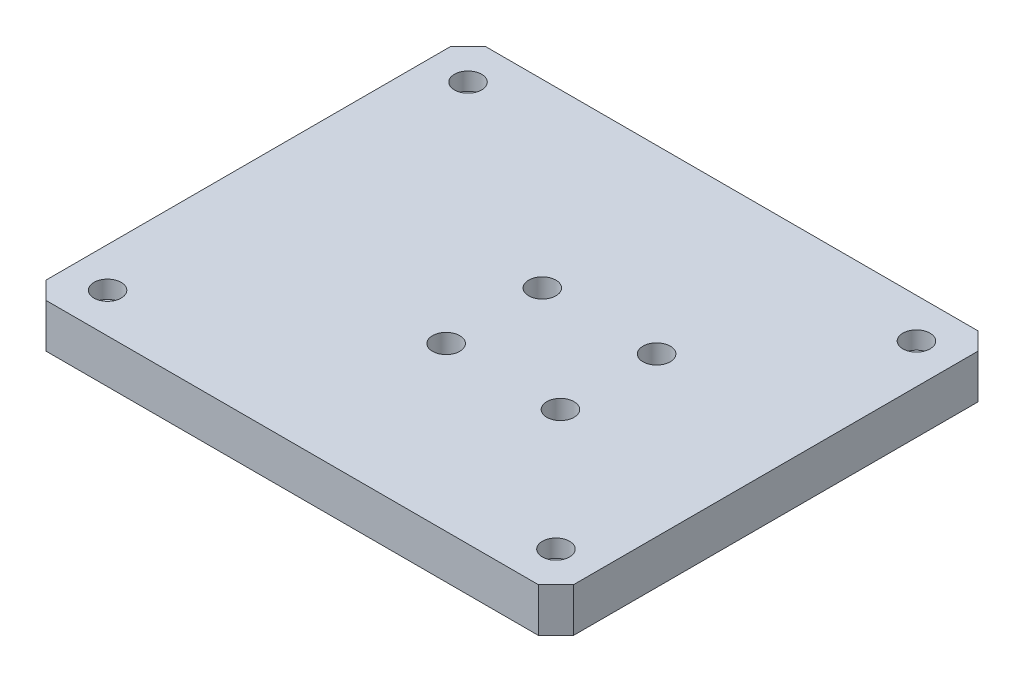
ISO-10303-21;
HEADER;
FILE_DESCRIPTION(('STEP AP214'),'2;1');
FILE_NAME('part.step','',(''),(''),'','','');
FILE_SCHEMA(('AUTOMOTIVE_DESIGN { 1 0 10303 214 1 1 1 1 }'));
ENDSEC;
DATA;
#1=APPLICATION_CONTEXT('core data for automotive mechanical design processes');
#2=APPLICATION_PROTOCOL_DEFINITION('international standard','automotive_design',2000,#1);
#3=PRODUCT_CONTEXT('',#1,'mechanical');
#4=PRODUCT('Part','Part','',(#3));
#5=PRODUCT_RELATED_PRODUCT_CATEGORY('part','',(#4));
#6=PRODUCT_DEFINITION_FORMATION('','',#4);
#7=PRODUCT_DEFINITION_CONTEXT('part definition',#1,'design');
#8=PRODUCT_DEFINITION('design','',#6,#7);
#9=PRODUCT_DEFINITION_SHAPE('','',#8);
#10=(LENGTH_UNIT() NAMED_UNIT(*) SI_UNIT(.MILLI.,.METRE.));
#11=(NAMED_UNIT(*) PLANE_ANGLE_UNIT() SI_UNIT($,.RADIAN.));
#12=(NAMED_UNIT(*) SI_UNIT($,.STERADIAN.) SOLID_ANGLE_UNIT());
#13=UNCERTAINTY_MEASURE_WITH_UNIT(LENGTH_MEASURE(1.E-05),#10,'distance_accuracy_value','');
#14=(GEOMETRIC_REPRESENTATION_CONTEXT(3) GLOBAL_UNCERTAINTY_ASSIGNED_CONTEXT((#13)) GLOBAL_UNIT_ASSIGNED_CONTEXT((#10,
#11,#12)) REPRESENTATION_CONTEXT('',''));
#15=CARTESIAN_POINT('',(0.,0.,0.));
#16=DIRECTION('',(0.,0.,1.));
#17=DIRECTION('',(1.,0.,0.));
#18=AXIS2_PLACEMENT_3D('',#15,#16,#17);
#19=CARTESIAN_POINT('',(0.,5.,0.));
#20=DIRECTION('',(1.,0.,0.));
#21=DIRECTION('',(0.,0.,-1.));
#22=AXIS2_PLACEMENT_3D('',#19,#20,#21);
#23=PLANE('',#22);
#24=DIRECTION('',(0.,0.,1.));
#25=VECTOR('',#24,1.);
#26=CARTESIAN_POINT('',(0.,0.,0.));
#27=LINE('',#26,#25);
#28=CARTESIAN_POINT('',(0.,0.,-48.));
#29=VERTEX_POINT('',#28);
#30=CARTESIAN_POINT('',(0.,0.,-2.00000000000002));
#31=VERTEX_POINT('',#30);
#32=EDGE_CURVE('E129',#29,#31,#27,.T.);
#33=ORIENTED_EDGE('',*,*,#32,.T.);
#34=DIRECTION('',(0.,1.,0.));
#35=VECTOR('',#34,1.);
#36=CARTESIAN_POINT('',(0.,5.,-2.00000000000002));
#37=LINE('',#36,#35);
#38=CARTESIAN_POINT('',(0.,5.,-2.00000000000002));
#39=VERTEX_POINT('',#38);
#40=EDGE_CURVE('E11',#31,#39,#37,.T.);
#41=ORIENTED_EDGE('',*,*,#40,.T.);
#42=DIRECTION('',(0.,0.,1.));
#43=VECTOR('',#42,1.);
#44=CARTESIAN_POINT('',(0.,5.,0.));
#45=LINE('',#44,#43);
#46=CARTESIAN_POINT('',(0.,5.,-48.));
#47=VERTEX_POINT('',#46);
#48=EDGE_CURVE('E127',#47,#39,#45,.T.);
#49=ORIENTED_EDGE('',*,*,#48,.F.);
#50=DIRECTION('',(0.,-1.,0.));
#51=VECTOR('',#50,1.);
#52=CARTESIAN_POINT('',(0.,5.,-48.));
#53=LINE('',#52,#51);
#54=EDGE_CURVE('E41',#47,#29,#53,.T.);
#55=ORIENTED_EDGE('',*,*,#54,.T.);
#56=EDGE_LOOP('',(#33,#41,#49,#55));
#57=FACE_BOUND('',#56,.T.);
#58=ADVANCED_FACE('F33',(#57),#23,.F.);
#59=CARTESIAN_POINT('',(0.,5.,0.));
#60=DIRECTION('',(0.,0.,-1.));
#61=DIRECTION('',(-1.,0.,0.));
#62=AXIS2_PLACEMENT_3D('',#59,#60,#61);
#63=PLANE('',#62);
#64=DIRECTION('',(1.,0.,0.));
#65=VECTOR('',#64,1.);
#66=CARTESIAN_POINT('',(0.,0.,0.));
#67=LINE('',#66,#65);
#68=CARTESIAN_POINT('',(2.00000000000001,0.,0.));
#69=VERTEX_POINT('',#68);
#70=CARTESIAN_POINT('',(58.,0.,0.));
#71=VERTEX_POINT('',#70);
#72=EDGE_CURVE('E125',#69,#71,#67,.T.);
#73=ORIENTED_EDGE('',*,*,#72,.T.);
#74=DIRECTION('',(0.,1.,0.));
#75=VECTOR('',#74,1.);
#76=CARTESIAN_POINT('',(58.,5.,0.));
#77=LINE('',#76,#75);
#78=CARTESIAN_POINT('',(58.,5.,0.));
#79=VERTEX_POINT('',#78);
#80=EDGE_CURVE('E104',#71,#79,#77,.T.);
#81=ORIENTED_EDGE('',*,*,#80,.T.);
#82=DIRECTION('',(1.,0.,0.));
#83=VECTOR('',#82,1.);
#84=CARTESIAN_POINT('',(0.,5.,0.));
#85=LINE('',#84,#83);
#86=CARTESIAN_POINT('',(2.00000000000001,5.,0.));
#87=VERTEX_POINT('',#86);
#88=EDGE_CURVE('E169',#87,#79,#85,.T.);
#89=ORIENTED_EDGE('',*,*,#88,.F.);
#90=DIRECTION('',(0.,-1.,0.));
#91=VECTOR('',#90,1.);
#92=CARTESIAN_POINT('',(2.00000000000001,5.,0.));
#93=LINE('',#92,#91);
#94=EDGE_CURVE('E109',#87,#69,#93,.T.);
#95=ORIENTED_EDGE('',*,*,#94,.T.);
#96=EDGE_LOOP('',(#73,#81,#89,#95));
#97=FACE_BOUND('',#96,.T.);
#98=ADVANCED_FACE('F242',(#97),#63,.F.);
#99=CARTESIAN_POINT('',(60.,5.,0.));
#100=DIRECTION('',(-1.,0.,0.));
#101=DIRECTION('',(0.,0.,1.));
#102=AXIS2_PLACEMENT_3D('',#99,#100,#101);
#103=PLANE('',#102);
#104=DIRECTION('',(0.,0.,-1.));
#105=VECTOR('',#104,1.);
#106=CARTESIAN_POINT('',(60.,5.,0.));
#107=LINE('',#106,#105);
#108=CARTESIAN_POINT('',(60.,5.,-2.00000000000001));
#109=VERTEX_POINT('',#108);
#110=CARTESIAN_POINT('',(60.,5.,-48.));
#111=VERTEX_POINT('',#110);
#112=EDGE_CURVE('E118',#109,#111,#107,.T.);
#113=ORIENTED_EDGE('',*,*,#112,.F.);
#114=DIRECTION('',(0.,-1.,0.));
#115=VECTOR('',#114,1.);
#116=CARTESIAN_POINT('',(60.,5.,-2.00000000000001));
#117=LINE('',#116,#115);
#118=CARTESIAN_POINT('',(60.,0.,-2.00000000000003));
#119=VERTEX_POINT('',#118);
#120=EDGE_CURVE('E103',#109,#119,#117,.T.);
#121=ORIENTED_EDGE('',*,*,#120,.T.);
#122=DIRECTION('',(0.,0.,-1.));
#123=VECTOR('',#122,1.);
#124=CARTESIAN_POINT('',(60.,0.,0.));
#125=LINE('',#124,#123);
#126=CARTESIAN_POINT('',(60.,0.,-48.));
#127=VERTEX_POINT('',#126);
#128=EDGE_CURVE('E116',#119,#127,#125,.T.);
#129=ORIENTED_EDGE('',*,*,#128,.T.);
#130=DIRECTION('',(0.,1.,0.));
#131=VECTOR('',#130,1.);
#132=CARTESIAN_POINT('',(60.,5.,-48.));
#133=LINE('',#132,#131);
#134=EDGE_CURVE('E120',#127,#111,#133,.T.);
#135=ORIENTED_EDGE('',*,*,#134,.T.);
#136=EDGE_LOOP('',(#113,#121,#129,#135));
#137=FACE_BOUND('',#136,.T.);
#138=ADVANCED_FACE('F115',(#137),#103,.F.);
#139=CARTESIAN_POINT('',(0.,5.,-50.));
#140=DIRECTION('',(0.,0.,1.));
#141=DIRECTION('',(1.,0.,0.));
#142=AXIS2_PLACEMENT_3D('',#139,#140,#141);
#143=PLANE('',#142);
#144=DIRECTION('',(-1.,0.,0.));
#145=VECTOR('',#144,1.);
#146=CARTESIAN_POINT('',(0.,5.,-50.));
#147=LINE('',#146,#145);
#148=CARTESIAN_POINT('',(58.,5.,-50.));
#149=VERTEX_POINT('',#148);
#150=CARTESIAN_POINT('',(2.00000000000002,5.,-50.));
#151=VERTEX_POINT('',#150);
#152=EDGE_CURVE('E133',#149,#151,#147,.T.);
#153=ORIENTED_EDGE('',*,*,#152,.F.);
#154=DIRECTION('',(0.,-1.,0.));
#155=VECTOR('',#154,1.);
#156=CARTESIAN_POINT('',(58.,5.,-50.));
#157=LINE('',#156,#155);
#158=CARTESIAN_POINT('',(58.,0.,-50.));
#159=VERTEX_POINT('',#158);
#160=EDGE_CURVE('E150',#149,#159,#157,.T.);
#161=ORIENTED_EDGE('',*,*,#160,.T.);
#162=DIRECTION('',(-1.,0.,0.));
#163=VECTOR('',#162,1.);
#164=CARTESIAN_POINT('',(0.,0.,-50.));
#165=LINE('',#164,#163);
#166=CARTESIAN_POINT('',(2.00000000000002,0.,-50.));
#167=VERTEX_POINT('',#166);
#168=EDGE_CURVE('E124',#159,#167,#165,.T.);
#169=ORIENTED_EDGE('',*,*,#168,.T.);
#170=DIRECTION('',(0.,1.,0.));
#171=VECTOR('',#170,1.);
#172=CARTESIAN_POINT('',(2.00000000000002,5.,-50.));
#173=LINE('',#172,#171);
#174=EDGE_CURVE('E48',#167,#151,#173,.T.);
#175=ORIENTED_EDGE('',*,*,#174,.T.);
#176=EDGE_LOOP('',(#153,#161,#169,#175));
#177=FACE_BOUND('',#176,.T.);
#178=ADVANCED_FACE('F223',(#177),#143,.F.);
#179=CARTESIAN_POINT('',(0.,5.,0.));
#180=DIRECTION('',(0.,-1.,0.));
#181=DIRECTION('',(0.,0.,-1.));
#182=AXIS2_PLACEMENT_3D('',#179,#180,#181);
#183=PLANE('',#182);
#184=CARTESIAN_POINT('',(29.,5.,-18.5090290205094));
#185=DIRECTION('',(0.,1.,0.));
#186=DIRECTION('',(0.,0.,1.));
#187=AXIS2_PLACEMENT_3D('',#184,#185,#186);
#188=CIRCLE('',#187,1.54999999999972);
#189=CARTESIAN_POINT('',(29.,5.,-16.9590290205097));
#190=VERTEX_POINT('',#189);
#191=EDGE_CURVE('E209',#190,#190,#188,.T.);
#192=ORIENTED_EDGE('',*,*,#191,.F.);
#193=EDGE_LOOP('',(#192));
#194=FACE_BOUND('',#193,.T.);
#195=CARTESIAN_POINT('',(42.,5.,-18.5090290205094));
#196=DIRECTION('',(0.,1.,0.));
#197=DIRECTION('',(0.,0.,1.));
#198=AXIS2_PLACEMENT_3D('',#195,#196,#197);
#199=CIRCLE('',#198,1.54999999999973);
#200=CARTESIAN_POINT('',(42.,5.,-16.9590290205097));
#201=VERTEX_POINT('',#200);
#202=EDGE_CURVE('E203',#201,#201,#199,.T.);
#203=ORIENTED_EDGE('',*,*,#202,.F.);
#204=EDGE_LOOP('',(#203));
#205=FACE_BOUND('',#204,.T.);
#206=CARTESIAN_POINT('',(29.,5.,-29.4460523784598));
#207=DIRECTION('',(0.,1.,0.));
#208=DIRECTION('',(0.,0.,1.));
#209=AXIS2_PLACEMENT_3D('',#206,#207,#208);
#210=CIRCLE('',#209,1.54999999999972);
#211=CARTESIAN_POINT('',(29.,5.,-27.8960523784601));
#212=VERTEX_POINT('',#211);
#213=EDGE_CURVE('E197',#212,#212,#210,.T.);
#214=ORIENTED_EDGE('',*,*,#213,.F.);
#215=EDGE_LOOP('',(#214));
#216=FACE_BOUND('',#215,.T.);
#217=CARTESIAN_POINT('',(42.,5.,-29.4460523784598));
#218=DIRECTION('',(0.,1.,0.));
#219=DIRECTION('',(0.,0.,1.));
#220=AXIS2_PLACEMENT_3D('',#217,#218,#219);
#221=CIRCLE('',#220,1.54999999999973);
#222=CARTESIAN_POINT('',(42.,5.,-27.8960523784601));
#223=VERTEX_POINT('',#222);
#224=EDGE_CURVE('E191',#223,#223,#221,.T.);
#225=ORIENTED_EDGE('',*,*,#224,.F.);
#226=EDGE_LOOP('',(#225));
#227=FACE_BOUND('',#226,.T.);
#228=CARTESIAN_POINT('',(55.5000000000025,5.,-45.5000000000097));
#229=DIRECTION('',(0.,1.,0.));
#230=DIRECTION('',(0.,0.,1.));
#231=AXIS2_PLACEMENT_3D('',#228,#229,#230);
#232=CIRCLE('',#231,1.54999999999479);
#233=CARTESIAN_POINT('',(55.5000000000025,5.,-43.9500000000149));
#234=VERTEX_POINT('',#233);
#235=EDGE_CURVE('E188',#234,#234,#232,.T.);
#236=ORIENTED_EDGE('',*,*,#235,.F.);
#237=EDGE_LOOP('',(#236));
#238=FACE_BOUND('',#237,.T.);
#239=CARTESIAN_POINT('',(4.50000000000252,5.,-45.5000000000097));
#240=DIRECTION('',(0.,1.,0.));
#241=DIRECTION('',(0.,0.,1.));
#242=AXIS2_PLACEMENT_3D('',#239,#240,#241);
#243=CIRCLE('',#242,1.5499999999948);
#244=CARTESIAN_POINT('',(4.50000000000252,5.,-43.9500000000149));
#245=VERTEX_POINT('',#244);
#246=EDGE_CURVE('E182',#245,#245,#243,.T.);
#247=ORIENTED_EDGE('',*,*,#246,.F.);
#248=EDGE_LOOP('',(#247));
#249=FACE_BOUND('',#248,.T.);
#250=CARTESIAN_POINT('',(4.50000000000253,5.,-4.50000000000968));
#251=DIRECTION('',(0.,1.,0.));
#252=DIRECTION('',(0.,0.,1.));
#253=AXIS2_PLACEMENT_3D('',#250,#251,#252);
#254=CIRCLE('',#253,1.54999999999479);
#255=CARTESIAN_POINT('',(4.50000000000253,5.,-2.95000000001489));
#256=VERTEX_POINT('',#255);
#257=EDGE_CURVE('E176',#256,#256,#254,.T.);
#258=ORIENTED_EDGE('',*,*,#257,.F.);
#259=EDGE_LOOP('',(#258));
#260=FACE_BOUND('',#259,.T.);
#261=CARTESIAN_POINT('',(55.5000000000025,5.,-4.5000000000097));
#262=DIRECTION('',(0.,1.,0.));
#263=DIRECTION('',(0.,0.,1.));
#264=AXIS2_PLACEMENT_3D('',#261,#262,#263);
#265=CIRCLE('',#264,1.54999999999478);
#266=CARTESIAN_POINT('',(55.5000000000025,5.,-2.95000000001491));
#267=VERTEX_POINT('',#266);
#268=EDGE_CURVE('E164',#267,#267,#265,.T.);
#269=ORIENTED_EDGE('',*,*,#268,.F.);
#270=EDGE_LOOP('',(#269));
#271=FACE_BOUND('',#270,.T.);
#272=ORIENTED_EDGE('',*,*,#88,.T.);
#273=DIRECTION('',(-0.707106781186549,0.,0.707106781186546));
#274=VECTOR('',#273,1.);
#275=CARTESIAN_POINT('',(60.,5.,-2.00000000000001));
#276=LINE('',#275,#274);
#277=EDGE_CURVE('E147',#79,#109,#276,.F.);
#278=ORIENTED_EDGE('',*,*,#277,.T.);
#279=ORIENTED_EDGE('',*,*,#112,.T.);
#280=DIRECTION('',(0.707106781186546,0.,0.707106781186549));
#281=VECTOR('',#280,1.);
#282=CARTESIAN_POINT('',(58.,5.,-50.));
#283=LINE('',#282,#281);
#284=EDGE_CURVE('E55',#111,#149,#283,.F.);
#285=ORIENTED_EDGE('',*,*,#284,.T.);
#286=ORIENTED_EDGE('',*,*,#152,.T.);
#287=DIRECTION('',(0.707106781186549,0.,-0.707106781186546));
#288=VECTOR('',#287,1.);
#289=CARTESIAN_POINT('',(0.,5.,-48.));
#290=LINE('',#289,#288);
#291=EDGE_CURVE('E142',#151,#47,#290,.F.);
#292=ORIENTED_EDGE('',*,*,#291,.T.);
#293=ORIENTED_EDGE('',*,*,#48,.T.);
#294=DIRECTION('',(-0.707106781186546,0.,-0.707106781186549));
#295=VECTOR('',#294,1.);
#296=CARTESIAN_POINT('',(2.00000000000001,5.,0.));
#297=LINE('',#296,#295);
#298=EDGE_CURVE('E144',#39,#87,#297,.F.);
#299=ORIENTED_EDGE('',*,*,#298,.T.);
#300=EDGE_LOOP('',(#272,#278,#279,#285,#286,#292,#293,#299));
#301=FACE_BOUND('',#300,.T.);
#302=ADVANCED_FACE('F220',(#194,#205,#216,#227,#238,#249,#260,#271,#301),#183,.F.);
#303=CARTESIAN_POINT('',(0.,0.,0.));
#304=DIRECTION('',(0.,-1.,0.));
#305=DIRECTION('',(0.,0.,-1.));
#306=AXIS2_PLACEMENT_3D('',#303,#304,#305);
#307=PLANE('',#306);
#308=CARTESIAN_POINT('',(29.,0.,-18.5090290205094));
#309=DIRECTION('',(0.,-1.,0.));
#310=DIRECTION('',(0.,0.,-1.));
#311=AXIS2_PLACEMENT_3D('',#308,#309,#310);
#312=CIRCLE('',#311,1.54999999999972);
#313=CARTESIAN_POINT('',(29.,0.,-20.0590290205091));
#314=VERTEX_POINT('',#313);
#315=EDGE_CURVE('E212',#314,#314,#312,.F.);
#316=ORIENTED_EDGE('',*,*,#315,.T.);
#317=EDGE_LOOP('',(#316));
#318=FACE_BOUND('',#317,.T.);
#319=CARTESIAN_POINT('',(42.,0.,-18.5090290205094));
#320=DIRECTION('',(0.,-1.,0.));
#321=DIRECTION('',(0.,0.,-1.));
#322=AXIS2_PLACEMENT_3D('',#319,#320,#321);
#323=CIRCLE('',#322,1.54999999999973);
#324=CARTESIAN_POINT('',(42.,0.,-20.0590290205091));
#325=VERTEX_POINT('',#324);
#326=EDGE_CURVE('E206',#325,#325,#323,.F.);
#327=ORIENTED_EDGE('',*,*,#326,.T.);
#328=EDGE_LOOP('',(#327));
#329=FACE_BOUND('',#328,.T.);
#330=CARTESIAN_POINT('',(29.,0.,-29.4460523784598));
#331=DIRECTION('',(0.,-1.,0.));
#332=DIRECTION('',(0.,0.,-1.));
#333=AXIS2_PLACEMENT_3D('',#330,#331,#332);
#334=CIRCLE('',#333,1.54999999999972);
#335=CARTESIAN_POINT('',(29.,0.,-30.9960523784595));
#336=VERTEX_POINT('',#335);
#337=EDGE_CURVE('E200',#336,#336,#334,.F.);
#338=ORIENTED_EDGE('',*,*,#337,.T.);
#339=EDGE_LOOP('',(#338));
#340=FACE_BOUND('',#339,.T.);
#341=CARTESIAN_POINT('',(42.,0.,-29.4460523784598));
#342=DIRECTION('',(0.,-1.,0.));
#343=DIRECTION('',(0.,0.,-1.));
#344=AXIS2_PLACEMENT_3D('',#341,#342,#343);
#345=CIRCLE('',#344,1.54999999999973);
#346=CARTESIAN_POINT('',(42.,0.,-30.9960523784595));
#347=VERTEX_POINT('',#346);
#348=EDGE_CURVE('E194',#347,#347,#345,.F.);
#349=ORIENTED_EDGE('',*,*,#348,.T.);
#350=EDGE_LOOP('',(#349));
#351=FACE_BOUND('',#350,.T.);
#352=ORIENTED_EDGE('',*,*,#128,.F.);
#353=DIRECTION('',(0.707106781186549,0.,-0.707106781186546));
#354=VECTOR('',#353,1.);
#355=CARTESIAN_POINT('',(28.9999999999999,0.,29.));
#356=LINE('',#355,#354);
#357=EDGE_CURVE('E99',#119,#71,#356,.F.);
#358=ORIENTED_EDGE('',*,*,#357,.T.);
#359=ORIENTED_EDGE('',*,*,#72,.F.);
#360=DIRECTION('',(0.707106781186546,0.,0.707106781186549));
#361=VECTOR('',#360,1.);
#362=CARTESIAN_POINT('',(1.00000000000001,0.,-1.));
#363=LINE('',#362,#361);
#364=EDGE_CURVE('E136',#69,#31,#363,.F.);
#365=ORIENTED_EDGE('',*,*,#364,.T.);
#366=ORIENTED_EDGE('',*,*,#32,.F.);
#367=DIRECTION('',(-0.707106781186549,0.,0.707106781186546));
#368=VECTOR('',#367,1.);
#369=CARTESIAN_POINT('',(-24.,0.,-24.0000000000001));
#370=LINE('',#369,#368);
#371=EDGE_CURVE('E119',#29,#167,#370,.F.);
#372=ORIENTED_EDGE('',*,*,#371,.T.);
#373=ORIENTED_EDGE('',*,*,#168,.F.);
#374=DIRECTION('',(-0.707106781186546,0.,-0.707106781186549));
#375=VECTOR('',#374,1.);
#376=CARTESIAN_POINT('',(54.0000000000001,0.,-53.9999999999999));
#377=LINE('',#376,#375);
#378=EDGE_CURVE('E110',#159,#127,#377,.F.);
#379=ORIENTED_EDGE('',*,*,#378,.T.);
#380=EDGE_LOOP('',(#352,#358,#359,#365,#366,#372,#373,#379));
#381=FACE_BOUND('',#380,.T.);
#382=ADVANCED_FACE('F122',(#318,#329,#340,#351,#381),#307,.T.);
#383=CARTESIAN_POINT('',(60.,5.,-2.00000000000001));
#384=DIRECTION('',(-0.707106781186546,0.,-0.707106781186549));
#385=DIRECTION('',(0.,-1.,0.));
#386=AXIS2_PLACEMENT_3D('',#383,#384,#385);
#387=PLANE('',#386);
#388=ORIENTED_EDGE('',*,*,#277,.F.);
#389=ORIENTED_EDGE('',*,*,#80,.F.);
#390=ORIENTED_EDGE('',*,*,#357,.F.);
#391=ORIENTED_EDGE('',*,*,#120,.F.);
#392=EDGE_LOOP('',(#388,#389,#390,#391));
#393=FACE_BOUND('',#392,.T.);
#394=ADVANCED_FACE('F102',(#393),#387,.F.);
#395=CARTESIAN_POINT('',(58.,5.,-50.));
#396=DIRECTION('',(-0.707106781186549,0.,0.707106781186546));
#397=DIRECTION('',(0.,-1.,0.));
#398=AXIS2_PLACEMENT_3D('',#395,#396,#397);
#399=PLANE('',#398);
#400=ORIENTED_EDGE('',*,*,#284,.F.);
#401=ORIENTED_EDGE('',*,*,#134,.F.);
#402=ORIENTED_EDGE('',*,*,#378,.F.);
#403=ORIENTED_EDGE('',*,*,#160,.F.);
#404=EDGE_LOOP('',(#400,#401,#402,#403));
#405=FACE_BOUND('',#404,.T.);
#406=ADVANCED_FACE('F254',(#405),#399,.F.);
#407=CARTESIAN_POINT('',(2.00000000000001,5.,0.));
#408=DIRECTION('',(0.707106781186549,0.,-0.707106781186546));
#409=DIRECTION('',(0.,-1.,0.));
#410=AXIS2_PLACEMENT_3D('',#407,#408,#409);
#411=PLANE('',#410);
#412=ORIENTED_EDGE('',*,*,#298,.F.);
#413=ORIENTED_EDGE('',*,*,#40,.F.);
#414=ORIENTED_EDGE('',*,*,#364,.F.);
#415=ORIENTED_EDGE('',*,*,#94,.F.);
#416=EDGE_LOOP('',(#412,#413,#414,#415));
#417=FACE_BOUND('',#416,.T.);
#418=ADVANCED_FACE('F244',(#417),#411,.F.);
#419=CARTESIAN_POINT('',(0.,5.,-48.));
#420=DIRECTION('',(0.707106781186546,0.,0.707106781186549));
#421=DIRECTION('',(0.,-1.,0.));
#422=AXIS2_PLACEMENT_3D('',#419,#420,#421);
#423=PLANE('',#422);
#424=ORIENTED_EDGE('',*,*,#291,.F.);
#425=ORIENTED_EDGE('',*,*,#174,.F.);
#426=ORIENTED_EDGE('',*,*,#371,.F.);
#427=ORIENTED_EDGE('',*,*,#54,.F.);
#428=EDGE_LOOP('',(#424,#425,#426,#427));
#429=FACE_BOUND('',#428,.T.);
#430=ADVANCED_FACE('F35',(#429),#423,.F.);
#431=CARTESIAN_POINT('',(55.5000000000025,3.,-4.5000000000097));
#432=DIRECTION('',(0.,1.,0.));
#433=DIRECTION('',(0.,0.,1.));
#434=AXIS2_PLACEMENT_3D('',#431,#432,#433);
#435=CYLINDRICAL_SURFACE('',#434,1.54999999999478);
#436=CARTESIAN_POINT('',(55.5000000000025,3.,-4.5000000000097));
#437=DIRECTION('',(0.,1.,0.));
#438=DIRECTION('',(0.,0.,1.));
#439=AXIS2_PLACEMENT_3D('',#436,#437,#438);
#440=CIRCLE('',#439,1.54999999999478);
#441=CARTESIAN_POINT('',(55.5000000000025,3.,-2.95000000001491));
#442=VERTEX_POINT('',#441);
#443=EDGE_CURVE('E162',#442,#442,#440,.T.);
#444=ORIENTED_EDGE('',*,*,#443,.F.);
#445=EDGE_LOOP('',(#444));
#446=FACE_BOUND('',#445,.T.);
#447=ORIENTED_EDGE('',*,*,#268,.T.);
#448=EDGE_LOOP('',(#447));
#449=FACE_BOUND('',#448,.T.);
#450=ADVANCED_FACE('F246',(#446,#449),#435,.F.);
#451=CARTESIAN_POINT('',(55.5000000000025,3.,-4.5000000000097));
#452=DIRECTION('',(0.,1.,0.));
#453=DIRECTION('',(0.,0.,1.));
#454=AXIS2_PLACEMENT_3D('',#451,#452,#453);
#455=PLANE('',#454);
#456=ORIENTED_EDGE('',*,*,#443,.T.);
#457=EDGE_LOOP('',(#456));
#458=FACE_BOUND('',#457,.T.);
#459=ADVANCED_FACE('F251',(#458),#455,.T.);
#460=CARTESIAN_POINT('',(4.50000000000253,3.,-4.50000000000968));
#461=DIRECTION('',(0.,1.,0.));
#462=DIRECTION('',(0.,0.,1.));
#463=AXIS2_PLACEMENT_3D('',#460,#461,#462);
#464=CYLINDRICAL_SURFACE('',#463,1.54999999999479);
#465=CARTESIAN_POINT('',(4.50000000000253,3.,-4.50000000000968));
#466=DIRECTION('',(0.,1.,0.));
#467=DIRECTION('',(0.,0.,1.));
#468=AXIS2_PLACEMENT_3D('',#465,#466,#467);
#469=CIRCLE('',#468,1.54999999999479);
#470=CARTESIAN_POINT('',(4.50000000000253,3.,-2.95000000001489));
#471=VERTEX_POINT('',#470);
#472=EDGE_CURVE('E174',#471,#471,#469,.T.);
#473=ORIENTED_EDGE('',*,*,#472,.F.);
#474=EDGE_LOOP('',(#473));
#475=FACE_BOUND('',#474,.T.);
#476=ORIENTED_EDGE('',*,*,#257,.T.);
#477=EDGE_LOOP('',(#476));
#478=FACE_BOUND('',#477,.T.);
#479=ADVANCED_FACE('F282',(#475,#478),#464,.F.);
#480=CARTESIAN_POINT('',(4.50000000000253,3.,-4.50000000000968));
#481=DIRECTION('',(0.,1.,0.));
#482=DIRECTION('',(0.,0.,1.));
#483=AXIS2_PLACEMENT_3D('',#480,#481,#482);
#484=PLANE('',#483);
#485=ORIENTED_EDGE('',*,*,#472,.T.);
#486=EDGE_LOOP('',(#485));
#487=FACE_BOUND('',#486,.T.);
#488=ADVANCED_FACE('F286',(#487),#484,.T.);
#489=CARTESIAN_POINT('',(4.50000000000252,3.,-45.5000000000097));
#490=DIRECTION('',(0.,1.,0.));
#491=DIRECTION('',(0.,0.,1.));
#492=AXIS2_PLACEMENT_3D('',#489,#490,#491);
#493=CYLINDRICAL_SURFACE('',#492,1.5499999999948);
#494=CARTESIAN_POINT('',(4.50000000000252,3.,-45.5000000000097));
#495=DIRECTION('',(0.,1.,0.));
#496=DIRECTION('',(0.,0.,1.));
#497=AXIS2_PLACEMENT_3D('',#494,#495,#496);
#498=CIRCLE('',#497,1.5499999999948);
#499=CARTESIAN_POINT('',(4.50000000000252,3.,-43.9500000000149));
#500=VERTEX_POINT('',#499);
#501=EDGE_CURVE('E179',#500,#500,#498,.T.);
#502=ORIENTED_EDGE('',*,*,#501,.F.);
#503=EDGE_LOOP('',(#502));
#504=FACE_BOUND('',#503,.T.);
#505=ORIENTED_EDGE('',*,*,#246,.T.);
#506=EDGE_LOOP('',(#505));
#507=FACE_BOUND('',#506,.T.);
#508=ADVANCED_FACE('F290',(#504,#507),#493,.F.);
#509=CARTESIAN_POINT('',(4.50000000000252,3.,-45.5000000000097));
#510=DIRECTION('',(0.,1.,0.));
#511=DIRECTION('',(0.,0.,1.));
#512=AXIS2_PLACEMENT_3D('',#509,#510,#511);
#513=PLANE('',#512);
#514=ORIENTED_EDGE('',*,*,#501,.T.);
#515=EDGE_LOOP('',(#514));
#516=FACE_BOUND('',#515,.T.);
#517=ADVANCED_FACE('F294',(#516),#513,.T.);
#518=CARTESIAN_POINT('',(55.5000000000025,3.,-45.5000000000097));
#519=DIRECTION('',(0.,1.,0.));
#520=DIRECTION('',(0.,0.,1.));
#521=AXIS2_PLACEMENT_3D('',#518,#519,#520);
#522=CYLINDRICAL_SURFACE('',#521,1.54999999999479);
#523=CARTESIAN_POINT('',(55.5000000000025,3.,-45.5000000000097));
#524=DIRECTION('',(0.,1.,0.));
#525=DIRECTION('',(0.,0.,1.));
#526=AXIS2_PLACEMENT_3D('',#523,#524,#525);
#527=CIRCLE('',#526,1.54999999999479);
#528=CARTESIAN_POINT('',(55.5000000000025,3.,-43.9500000000149));
#529=VERTEX_POINT('',#528);
#530=EDGE_CURVE('E185',#529,#529,#527,.T.);
#531=ORIENTED_EDGE('',*,*,#530,.F.);
#532=EDGE_LOOP('',(#531));
#533=FACE_BOUND('',#532,.T.);
#534=ORIENTED_EDGE('',*,*,#235,.T.);
#535=EDGE_LOOP('',(#534));
#536=FACE_BOUND('',#535,.T.);
#537=ADVANCED_FACE('F298',(#533,#536),#522,.F.);
#538=CARTESIAN_POINT('',(55.5000000000025,3.,-45.5000000000097));
#539=DIRECTION('',(0.,1.,0.));
#540=DIRECTION('',(0.,0.,1.));
#541=AXIS2_PLACEMENT_3D('',#538,#539,#540);
#542=PLANE('',#541);
#543=ORIENTED_EDGE('',*,*,#530,.T.);
#544=EDGE_LOOP('',(#543));
#545=FACE_BOUND('',#544,.T.);
#546=ADVANCED_FACE('F302',(#545),#542,.T.);
#547=CARTESIAN_POINT('',(42.,-0.00100000000000013,-29.4460523784598));
#548=DIRECTION('',(0.,1.,0.));
#549=DIRECTION('',(0.,0.,1.));
#550=AXIS2_PLACEMENT_3D('',#547,#548,#549);
#551=CYLINDRICAL_SURFACE('',#550,1.54999999999973);
#552=ORIENTED_EDGE('',*,*,#348,.F.);
#553=EDGE_LOOP('',(#552));
#554=FACE_BOUND('',#553,.T.);
#555=ORIENTED_EDGE('',*,*,#224,.T.);
#556=EDGE_LOOP('',(#555));
#557=FACE_BOUND('',#556,.T.);
#558=ADVANCED_FACE('F306',(#554,#557),#551,.F.);
#559=CARTESIAN_POINT('',(29.,-0.00100000000000013,-29.4460523784598));
#560=DIRECTION('',(0.,1.,0.));
#561=DIRECTION('',(0.,0.,1.));
#562=AXIS2_PLACEMENT_3D('',#559,#560,#561);
#563=CYLINDRICAL_SURFACE('',#562,1.54999999999972);
#564=ORIENTED_EDGE('',*,*,#337,.F.);
#565=EDGE_LOOP('',(#564));
#566=FACE_BOUND('',#565,.T.);
#567=ORIENTED_EDGE('',*,*,#213,.T.);
#568=EDGE_LOOP('',(#567));
#569=FACE_BOUND('',#568,.T.);
#570=ADVANCED_FACE('F310',(#566,#569),#563,.F.);
#571=CARTESIAN_POINT('',(42.,-0.00100000000000013,-18.5090290205094));
#572=DIRECTION('',(0.,1.,0.));
#573=DIRECTION('',(0.,0.,1.));
#574=AXIS2_PLACEMENT_3D('',#571,#572,#573);
#575=CYLINDRICAL_SURFACE('',#574,1.54999999999973);
#576=ORIENTED_EDGE('',*,*,#326,.F.);
#577=EDGE_LOOP('',(#576));
#578=FACE_BOUND('',#577,.T.);
#579=ORIENTED_EDGE('',*,*,#202,.T.);
#580=EDGE_LOOP('',(#579));
#581=FACE_BOUND('',#580,.T.);
#582=ADVANCED_FACE('F314',(#578,#581),#575,.F.);
#583=CARTESIAN_POINT('',(29.,-0.00100000000000013,-18.5090290205094));
#584=DIRECTION('',(0.,1.,0.));
#585=DIRECTION('',(0.,0.,1.));
#586=AXIS2_PLACEMENT_3D('',#583,#584,#585);
#587=CYLINDRICAL_SURFACE('',#586,1.54999999999972);
#588=ORIENTED_EDGE('',*,*,#315,.F.);
#589=EDGE_LOOP('',(#588));
#590=FACE_BOUND('',#589,.T.);
#591=ORIENTED_EDGE('',*,*,#191,.T.);
#592=EDGE_LOOP('',(#591));
#593=FACE_BOUND('',#592,.T.);
#594=ADVANCED_FACE('F218',(#590,#593),#587,.F.);
#595=CLOSED_SHELL('',(#58,#98,#138,#178,#302,#382,#394,#406,#418,#430,#450,#459,#479,#488,#508,
#517,#537,#546,#558,#570,#582,#594));
#596=MANIFOLD_SOLID_BREP('B2',#595);
#597=ADVANCED_BREP_SHAPE_REPRESENTATION('',(#18,#596),#14);
#598=SHAPE_DEFINITION_REPRESENTATION(#9,#597);
ENDSEC;
END-ISO-10303-21;
